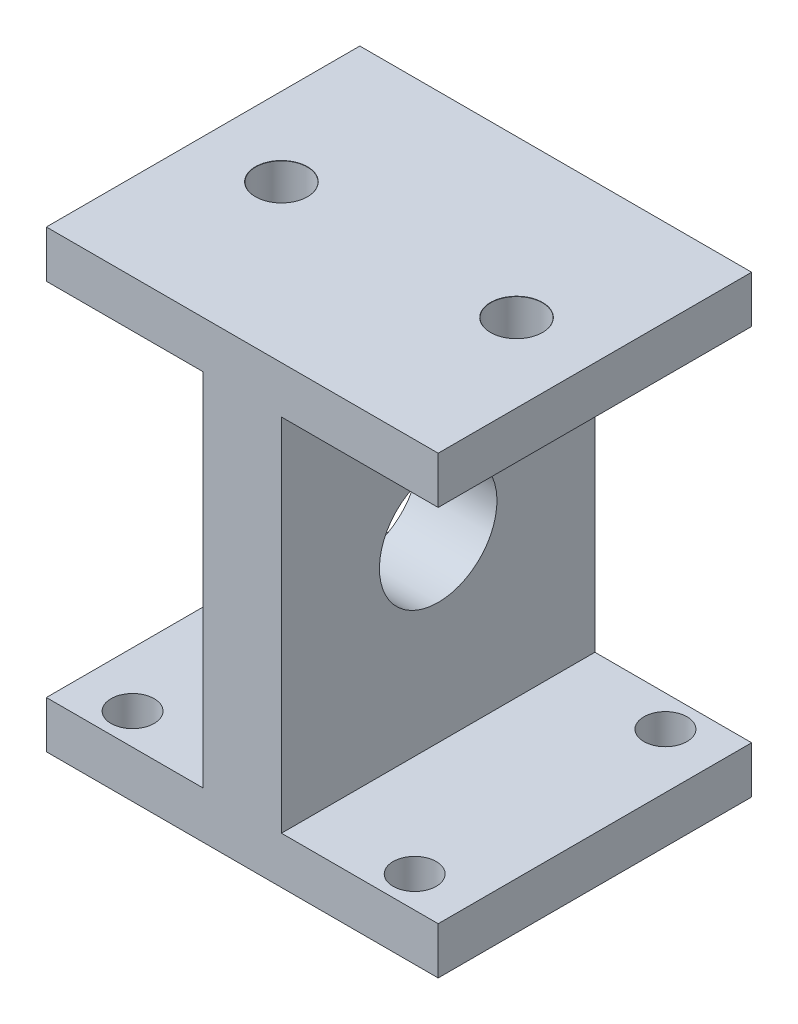
ISO-10303-21;
HEADER;
FILE_DESCRIPTION(('STEP AP214'),'2;1');
FILE_NAME('part.step','',(''),(''),'','','');
FILE_SCHEMA(('AUTOMOTIVE_DESIGN { 1 0 10303 214 1 1 1 1 }'));
ENDSEC;
DATA;
#1=APPLICATION_CONTEXT('core data for automotive mechanical design processes');
#2=APPLICATION_PROTOCOL_DEFINITION('international standard','automotive_design',2000,#1);
#3=PRODUCT_CONTEXT('',#1,'mechanical');
#4=PRODUCT('Part','Part','',(#3));
#5=PRODUCT_RELATED_PRODUCT_CATEGORY('part','',(#4));
#6=PRODUCT_DEFINITION_FORMATION('','',#4);
#7=PRODUCT_DEFINITION_CONTEXT('part definition',#1,'design');
#8=PRODUCT_DEFINITION('design','',#6,#7);
#9=PRODUCT_DEFINITION_SHAPE('','',#8);
#10=(LENGTH_UNIT() NAMED_UNIT(*) SI_UNIT(.MILLI.,.METRE.));
#11=(NAMED_UNIT(*) PLANE_ANGLE_UNIT() SI_UNIT($,.RADIAN.));
#12=(NAMED_UNIT(*) SI_UNIT($,.STERADIAN.) SOLID_ANGLE_UNIT());
#13=UNCERTAINTY_MEASURE_WITH_UNIT(LENGTH_MEASURE(1.E-05),#10,'distance_accuracy_value','');
#14=(GEOMETRIC_REPRESENTATION_CONTEXT(3) GLOBAL_UNCERTAINTY_ASSIGNED_CONTEXT((#13)) GLOBAL_UNIT_ASSIGNED_CONTEXT((#10,
#11,#12)) REPRESENTATION_CONTEXT('',''));
#15=CARTESIAN_POINT('',(0.,0.,0.));
#16=DIRECTION('',(0.,0.,1.));
#17=DIRECTION('',(1.,0.,0.));
#18=AXIS2_PLACEMENT_3D('',#15,#16,#17);
#19=CARTESIAN_POINT('',(25.,29.,40.));
#20=DIRECTION('',(-1.,0.,0.));
#21=DIRECTION('',(0.,-1.,0.));
#22=AXIS2_PLACEMENT_3D('',#19,#20,#21);
#23=PLANE('',#22);
#24=DIRECTION('',(0.,1.,0.));
#25=VECTOR('',#24,1.);
#26=CARTESIAN_POINT('',(25.,29.,40.));
#27=LINE('',#26,#25);
#28=CARTESIAN_POINT('',(25.,23.,40.));
#29=VERTEX_POINT('',#28);
#30=CARTESIAN_POINT('',(25.,29.,40.));
#31=VERTEX_POINT('',#30);
#32=EDGE_CURVE('E195',#29,#31,#27,.T.);
#33=ORIENTED_EDGE('',*,*,#32,.F.);
#34=DIRECTION('',(0.,0.,-1.));
#35=VECTOR('',#34,1.);
#36=CARTESIAN_POINT('',(25.,23.,40.));
#37=LINE('',#36,#35);
#38=CARTESIAN_POINT('',(25.,23.,0.));
#39=VERTEX_POINT('',#38);
#40=EDGE_CURVE('E179',#29,#39,#37,.T.);
#41=ORIENTED_EDGE('',*,*,#40,.T.);
#42=DIRECTION('',(0.,1.,0.));
#43=VECTOR('',#42,1.);
#44=CARTESIAN_POINT('',(25.,29.,0.));
#45=LINE('',#44,#43);
#46=CARTESIAN_POINT('',(25.,29.,0.));
#47=VERTEX_POINT('',#46);
#48=EDGE_CURVE('E189',#39,#47,#45,.T.);
#49=ORIENTED_EDGE('',*,*,#48,.T.);
#50=DIRECTION('',(0.,0.,-1.));
#51=VECTOR('',#50,1.);
#52=CARTESIAN_POINT('',(25.,29.,40.));
#53=LINE('',#52,#51);
#54=EDGE_CURVE('E232',#31,#47,#53,.T.);
#55=ORIENTED_EDGE('',*,*,#54,.F.);
#56=EDGE_LOOP('',(#33,#41,#49,#55));
#57=FACE_BOUND('',#56,.T.);
#58=ADVANCED_FACE('F38',(#57),#23,.F.);
#59=CARTESIAN_POINT('',(-25.,29.,40.));
#60=DIRECTION('',(1.,0.,0.));
#61=DIRECTION('',(0.,1.,0.));
#62=AXIS2_PLACEMENT_3D('',#59,#60,#61);
#63=PLANE('',#62);
#64=DIRECTION('',(0.,-1.,0.));
#65=VECTOR('',#64,1.);
#66=CARTESIAN_POINT('',(-25.,29.,0.));
#67=LINE('',#66,#65);
#68=CARTESIAN_POINT('',(-25.,29.,0.));
#69=VERTEX_POINT('',#68);
#70=CARTESIAN_POINT('',(-25.,23.,0.));
#71=VERTEX_POINT('',#70);
#72=EDGE_CURVE('E214',#69,#71,#67,.T.);
#73=ORIENTED_EDGE('',*,*,#72,.T.);
#74=DIRECTION('',(0.,0.,1.));
#75=VECTOR('',#74,1.);
#76=CARTESIAN_POINT('',(-25.,23.,40.));
#77=LINE('',#76,#75);
#78=CARTESIAN_POINT('',(-25.,23.,40.));
#79=VERTEX_POINT('',#78);
#80=EDGE_CURVE('E185',#71,#79,#77,.T.);
#81=ORIENTED_EDGE('',*,*,#80,.T.);
#82=DIRECTION('',(0.,-1.,0.));
#83=VECTOR('',#82,1.);
#84=CARTESIAN_POINT('',(-25.,29.,40.));
#85=LINE('',#84,#83);
#86=CARTESIAN_POINT('',(-25.,29.,40.));
#87=VERTEX_POINT('',#86);
#88=EDGE_CURVE('E199',#87,#79,#85,.T.);
#89=ORIENTED_EDGE('',*,*,#88,.F.);
#90=DIRECTION('',(0.,0.,-1.));
#91=VECTOR('',#90,1.);
#92=CARTESIAN_POINT('',(-25.,29.,40.));
#93=LINE('',#92,#91);
#94=EDGE_CURVE('E228',#87,#69,#93,.T.);
#95=ORIENTED_EDGE('',*,*,#94,.T.);
#96=EDGE_LOOP('',(#73,#81,#89,#95));
#97=FACE_BOUND('',#96,.T.);
#98=ADVANCED_FACE('F342',(#97),#63,.F.);
#99=CARTESIAN_POINT('',(25.,-29.,0.));
#100=VERTEX_POINT('',#99);
#101=CARTESIAN_POINT('',(25.,-23.,0.));
#102=VERTEX_POINT('',#101);
#103=EDGE_CURVE('E206',#100,#102,#45,.T.);
#104=ORIENTED_EDGE('',*,*,#103,.T.);
#105=DIRECTION('',(0.,0.,1.));
#106=VECTOR('',#105,1.);
#107=CARTESIAN_POINT('',(25.,-23.,40.));
#108=LINE('',#107,#106);
#109=CARTESIAN_POINT('',(25.,-23.,40.));
#110=VERTEX_POINT('',#109);
#111=EDGE_CURVE('E158',#102,#110,#108,.T.);
#112=ORIENTED_EDGE('',*,*,#111,.T.);
#113=CARTESIAN_POINT('',(25.,-29.,40.));
#114=VERTEX_POINT('',#113);
#115=EDGE_CURVE('E190',#114,#110,#27,.T.);
#116=ORIENTED_EDGE('',*,*,#115,.F.);
#117=DIRECTION('',(0.,0.,-1.));
#118=VECTOR('',#117,1.);
#119=CARTESIAN_POINT('',(25.,-29.,40.));
#120=LINE('',#119,#118);
#121=EDGE_CURVE('E205',#114,#100,#120,.T.);
#122=ORIENTED_EDGE('',*,*,#121,.T.);
#123=EDGE_LOOP('',(#104,#112,#116,#122));
#124=FACE_BOUND('',#123,.T.);
#125=ADVANCED_FACE('F40',(#124),#23,.F.);
#126=CARTESIAN_POINT('',(-25.,29.,40.));
#127=DIRECTION('',(0.,-1.,0.));
#128=DIRECTION('',(0.,0.,-1.));
#129=AXIS2_PLACEMENT_3D('',#126,#127,#128);
#130=PLANE('',#129);
#131=CARTESIAN_POINT('',(-15.,29.,20.));
#132=DIRECTION('',(0.,1.,0.));
#133=DIRECTION('',(0.,0.,1.));
#134=AXIS2_PLACEMENT_3D('',#131,#132,#133);
#135=CIRCLE('',#134,3.325);
#136=CARTESIAN_POINT('',(-15.,29.,23.325));
#137=VERTEX_POINT('',#136);
#138=EDGE_CURVE('E597',#137,#137,#135,.T.);
#139=ORIENTED_EDGE('',*,*,#138,.F.);
#140=EDGE_LOOP('',(#139));
#141=FACE_BOUND('',#140,.T.);
#142=CARTESIAN_POINT('',(15.,29.,20.));
#143=DIRECTION('',(0.,1.,0.));
#144=DIRECTION('',(0.,0.,1.));
#145=AXIS2_PLACEMENT_3D('',#142,#143,#144);
#146=CIRCLE('',#145,3.325);
#147=CARTESIAN_POINT('',(15.,29.,23.325));
#148=VERTEX_POINT('',#147);
#149=EDGE_CURVE('E288',#148,#148,#146,.T.);
#150=ORIENTED_EDGE('',*,*,#149,.F.);
#151=EDGE_LOOP('',(#150));
#152=FACE_BOUND('',#151,.T.);
#153=DIRECTION('',(-1.,0.,0.));
#154=VECTOR('',#153,1.);
#155=CARTESIAN_POINT('',(-25.,29.,0.));
#156=LINE('',#155,#154);
#157=EDGE_CURVE('E210',#47,#69,#156,.T.);
#158=ORIENTED_EDGE('',*,*,#157,.T.);
#159=ORIENTED_EDGE('',*,*,#94,.F.);
#160=DIRECTION('',(-1.,0.,0.));
#161=VECTOR('',#160,1.);
#162=CARTESIAN_POINT('',(-25.,29.,40.));
#163=LINE('',#162,#161);
#164=EDGE_CURVE('E194',#31,#87,#163,.T.);
#165=ORIENTED_EDGE('',*,*,#164,.F.);
#166=ORIENTED_EDGE('',*,*,#54,.T.);
#167=EDGE_LOOP('',(#158,#159,#165,#166));
#168=FACE_BOUND('',#167,.T.);
#169=ADVANCED_FACE('F352',(#141,#152,#168),#130,.F.);
#170=CARTESIAN_POINT('',(-25.,-23.,40.));
#171=VERTEX_POINT('',#170);
#172=CARTESIAN_POINT('',(-25.,-29.,40.));
#173=VERTEX_POINT('',#172);
#174=EDGE_CURVE('E198',#171,#173,#85,.T.);
#175=ORIENTED_EDGE('',*,*,#174,.F.);
#176=DIRECTION('',(0.,0.,-1.));
#177=VECTOR('',#176,1.);
#178=CARTESIAN_POINT('',(-25.,-23.,40.));
#179=LINE('',#178,#177);
#180=CARTESIAN_POINT('',(-25.,-23.,0.));
#181=VERTEX_POINT('',#180);
#182=EDGE_CURVE('E144',#171,#181,#179,.T.);
#183=ORIENTED_EDGE('',*,*,#182,.T.);
#184=CARTESIAN_POINT('',(-25.,-29.,0.));
#185=VERTEX_POINT('',#184);
#186=EDGE_CURVE('E213',#181,#185,#67,.T.);
#187=ORIENTED_EDGE('',*,*,#186,.T.);
#188=DIRECTION('',(0.,0.,-1.));
#189=VECTOR('',#188,1.);
#190=CARTESIAN_POINT('',(-25.,-29.,40.));
#191=LINE('',#190,#189);
#192=EDGE_CURVE('E224',#173,#185,#191,.T.);
#193=ORIENTED_EDGE('',*,*,#192,.F.);
#194=EDGE_LOOP('',(#175,#183,#187,#193));
#195=FACE_BOUND('',#194,.T.);
#196=ADVANCED_FACE('F349',(#195),#63,.F.);
#197=CARTESIAN_POINT('',(-25.,-29.,40.));
#198=DIRECTION('',(0.,1.,0.));
#199=DIRECTION('',(0.,0.,1.));
#200=AXIS2_PLACEMENT_3D('',#197,#198,#199);
#201=PLANE('',#200);
#202=CARTESIAN_POINT('',(18.,-29.,4.));
#203=DIRECTION('',(0.,-1.,0.));
#204=DIRECTION('',(0.,0.,-1.));
#205=AXIS2_PLACEMENT_3D('',#202,#203,#204);
#206=CIRCLE('',#205,2.775);
#207=CARTESIAN_POINT('',(18.,-29.,1.225));
#208=VERTEX_POINT('',#207);
#209=EDGE_CURVE('E279',#208,#208,#206,.T.);
#210=ORIENTED_EDGE('',*,*,#209,.F.);
#211=EDGE_LOOP('',(#210));
#212=FACE_BOUND('',#211,.T.);
#213=CARTESIAN_POINT('',(-18.,-29.,3.99999999999999));
#214=DIRECTION('',(0.,-1.,0.));
#215=DIRECTION('',(0.,0.,-1.));
#216=AXIS2_PLACEMENT_3D('',#213,#214,#215);
#217=CIRCLE('',#216,2.775);
#218=CARTESIAN_POINT('',(-18.,-29.,1.225));
#219=VERTEX_POINT('',#218);
#220=EDGE_CURVE('E274',#219,#219,#217,.T.);
#221=ORIENTED_EDGE('',*,*,#220,.F.);
#222=EDGE_LOOP('',(#221));
#223=FACE_BOUND('',#222,.T.);
#224=CARTESIAN_POINT('',(-18.,-29.,36.));
#225=DIRECTION('',(0.,-1.,0.));
#226=DIRECTION('',(0.,0.,-1.));
#227=AXIS2_PLACEMENT_3D('',#224,#225,#226);
#228=CIRCLE('',#227,2.775);
#229=CARTESIAN_POINT('',(-18.,-29.,33.225));
#230=VERTEX_POINT('',#229);
#231=EDGE_CURVE('E269',#230,#230,#228,.T.);
#232=ORIENTED_EDGE('',*,*,#231,.F.);
#233=EDGE_LOOP('',(#232));
#234=FACE_BOUND('',#233,.T.);
#235=CARTESIAN_POINT('',(18.,-29.,36.));
#236=DIRECTION('',(0.,-1.,0.));
#237=DIRECTION('',(0.,0.,-1.));
#238=AXIS2_PLACEMENT_3D('',#235,#236,#237);
#239=CIRCLE('',#238,2.775);
#240=CARTESIAN_POINT('',(18.,-29.,33.225));
#241=VERTEX_POINT('',#240);
#242=EDGE_CURVE('E263',#241,#241,#239,.T.);
#243=ORIENTED_EDGE('',*,*,#242,.F.);
#244=EDGE_LOOP('',(#243));
#245=FACE_BOUND('',#244,.T.);
#246=DIRECTION('',(1.,0.,0.));
#247=VECTOR('',#246,1.);
#248=CARTESIAN_POINT('',(-25.,-29.,0.));
#249=LINE('',#248,#247);
#250=EDGE_CURVE('E218',#185,#100,#249,.T.);
#251=ORIENTED_EDGE('',*,*,#250,.T.);
#252=ORIENTED_EDGE('',*,*,#121,.F.);
#253=DIRECTION('',(1.,0.,0.));
#254=VECTOR('',#253,1.);
#255=CARTESIAN_POINT('',(-25.,-29.,40.));
#256=LINE('',#255,#254);
#257=EDGE_CURVE('E202',#173,#114,#256,.T.);
#258=ORIENTED_EDGE('',*,*,#257,.F.);
#259=ORIENTED_EDGE('',*,*,#192,.T.);
#260=EDGE_LOOP('',(#251,#252,#258,#259));
#261=FACE_BOUND('',#260,.T.);
#262=ADVANCED_FACE('F373',(#212,#223,#234,#245,#261),#201,.F.);
#263=CARTESIAN_POINT('',(0.,0.,40.));
#264=DIRECTION('',(0.,0.,1.));
#265=DIRECTION('',(1.,0.,0.));
#266=AXIS2_PLACEMENT_3D('',#263,#264,#265);
#267=PLANE('',#266);
#268=DIRECTION('',(-1.,0.,0.));
#269=VECTOR('',#268,1.);
#270=CARTESIAN_POINT('',(-37.7928187136335,23.,40.));
#271=LINE('',#270,#269);
#272=CARTESIAN_POINT('',(-5.,23.,40.));
#273=VERTEX_POINT('',#272);
#274=EDGE_CURVE('E138',#273,#79,#271,.T.);
#275=ORIENTED_EDGE('',*,*,#274,.F.);
#276=DIRECTION('',(0.,1.,0.));
#277=VECTOR('',#276,1.);
#278=CARTESIAN_POINT('',(-5.,23.,40.));
#279=LINE('',#278,#277);
#280=CARTESIAN_POINT('',(-4.99999999999999,-23.,40.));
#281=VERTEX_POINT('',#280);
#282=EDGE_CURVE('E132',#281,#273,#279,.T.);
#283=ORIENTED_EDGE('',*,*,#282,.F.);
#284=DIRECTION('',(1.,0.,0.));
#285=VECTOR('',#284,1.);
#286=CARTESIAN_POINT('',(-37.7928187136335,-23.,40.));
#287=LINE('',#286,#285);
#288=EDGE_CURVE('E141',#171,#281,#287,.T.);
#289=ORIENTED_EDGE('',*,*,#288,.F.);
#290=ORIENTED_EDGE('',*,*,#174,.T.);
#291=ORIENTED_EDGE('',*,*,#257,.T.);
#292=ORIENTED_EDGE('',*,*,#115,.T.);
#293=DIRECTION('',(1.,0.,0.));
#294=VECTOR('',#293,1.);
#295=CARTESIAN_POINT('',(37.7928187136335,-23.,40.));
#296=LINE('',#295,#294);
#297=CARTESIAN_POINT('',(4.99999999999999,-23.,40.));
#298=VERTEX_POINT('',#297);
#299=EDGE_CURVE('E167',#298,#110,#296,.T.);
#300=ORIENTED_EDGE('',*,*,#299,.F.);
#301=DIRECTION('',(0.,-1.,0.));
#302=VECTOR('',#301,1.);
#303=CARTESIAN_POINT('',(5.,23.,40.));
#304=LINE('',#303,#302);
#305=CARTESIAN_POINT('',(5.,23.,40.));
#306=VERTEX_POINT('',#305);
#307=EDGE_CURVE('E163',#306,#298,#304,.T.);
#308=ORIENTED_EDGE('',*,*,#307,.F.);
#309=DIRECTION('',(-1.,0.,0.));
#310=VECTOR('',#309,1.);
#311=CARTESIAN_POINT('',(37.7928187136335,23.,40.));
#312=LINE('',#311,#310);
#313=EDGE_CURVE('E160',#29,#306,#312,.T.);
#314=ORIENTED_EDGE('',*,*,#313,.F.);
#315=ORIENTED_EDGE('',*,*,#32,.T.);
#316=ORIENTED_EDGE('',*,*,#164,.T.);
#317=ORIENTED_EDGE('',*,*,#88,.T.);
#318=EDGE_LOOP('',(#275,#283,#289,#290,#291,#292,#300,#308,#314,#315,#316,#317));
#319=FACE_BOUND('',#318,.T.);
#320=ADVANCED_FACE('F149',(#319),#267,.T.);
#321=CARTESIAN_POINT('',(0.,0.,0.));
#322=DIRECTION('',(0.,0.,1.));
#323=DIRECTION('',(1.,0.,0.));
#324=AXIS2_PLACEMENT_3D('',#321,#322,#323);
#325=PLANE('',#324);
#326=DIRECTION('',(0.,1.,0.));
#327=VECTOR('',#326,1.);
#328=CARTESIAN_POINT('',(-4.99999999999999,0.,0.));
#329=LINE('',#328,#327);
#330=CARTESIAN_POINT('',(-4.99999999999999,-23.,0.));
#331=VERTEX_POINT('',#330);
#332=CARTESIAN_POINT('',(-5.,23.,0.));
#333=VERTEX_POINT('',#332);
#334=EDGE_CURVE('E48',#331,#333,#329,.T.);
#335=ORIENTED_EDGE('',*,*,#334,.T.);
#336=DIRECTION('',(-1.,0.,0.));
#337=VECTOR('',#336,1.);
#338=CARTESIAN_POINT('',(0.,23.,0.));
#339=LINE('',#338,#337);
#340=EDGE_CURVE('E11',#333,#71,#339,.T.);
#341=ORIENTED_EDGE('',*,*,#340,.T.);
#342=ORIENTED_EDGE('',*,*,#72,.F.);
#343=ORIENTED_EDGE('',*,*,#157,.F.);
#344=ORIENTED_EDGE('',*,*,#48,.F.);
#345=DIRECTION('',(-1.,0.,0.));
#346=VECTOR('',#345,1.);
#347=CARTESIAN_POINT('',(0.,23.,0.));
#348=LINE('',#347,#346);
#349=CARTESIAN_POINT('',(5.,23.,0.));
#350=VERTEX_POINT('',#349);
#351=EDGE_CURVE('E244',#39,#350,#348,.T.);
#352=ORIENTED_EDGE('',*,*,#351,.T.);
#353=DIRECTION('',(0.,-1.,0.));
#354=VECTOR('',#353,1.);
#355=CARTESIAN_POINT('',(4.99999999999999,0.,0.));
#356=LINE('',#355,#354);
#357=CARTESIAN_POINT('',(4.99999999999999,-23.,0.));
#358=VERTEX_POINT('',#357);
#359=EDGE_CURVE('E236',#350,#358,#356,.T.);
#360=ORIENTED_EDGE('',*,*,#359,.T.);
#361=DIRECTION('',(1.,0.,0.));
#362=VECTOR('',#361,1.);
#363=CARTESIAN_POINT('',(0.,-23.,0.));
#364=LINE('',#363,#362);
#365=EDGE_CURVE('E240',#358,#102,#364,.T.);
#366=ORIENTED_EDGE('',*,*,#365,.T.);
#367=ORIENTED_EDGE('',*,*,#103,.F.);
#368=ORIENTED_EDGE('',*,*,#250,.F.);
#369=ORIENTED_EDGE('',*,*,#186,.F.);
#370=DIRECTION('',(1.,0.,0.));
#371=VECTOR('',#370,1.);
#372=CARTESIAN_POINT('',(0.,-23.,0.));
#373=LINE('',#372,#371);
#374=EDGE_CURVE('E248',#181,#331,#373,.T.);
#375=ORIENTED_EDGE('',*,*,#374,.T.);
#376=EDGE_LOOP('',(#335,#341,#342,#343,#344,#352,#360,#366,#367,#368,#369,#375));
#377=FACE_BOUND('',#376,.T.);
#378=ADVANCED_FACE('F363',(#377),#325,.F.);
#379=CARTESIAN_POINT('',(37.7928187136335,23.,-20.));
#380=DIRECTION('',(0.,1.,0.));
#381=DIRECTION('',(0.,0.,1.));
#382=AXIS2_PLACEMENT_3D('',#379,#380,#381);
#383=PLANE('',#382);
#384=CARTESIAN_POINT('',(15.,23.,20.));
#385=DIRECTION('',(0.,1.,0.));
#386=DIRECTION('',(0.,0.,1.));
#387=AXIS2_PLACEMENT_3D('',#384,#385,#386);
#388=CIRCLE('',#387,3.3);
#389=CARTESIAN_POINT('',(15.,23.,23.3));
#390=VERTEX_POINT('',#389);
#391=EDGE_CURVE('E276',#390,#390,#388,.T.);
#392=ORIENTED_EDGE('',*,*,#391,.T.);
#393=EDGE_LOOP('',(#392));
#394=FACE_BOUND('',#393,.T.);
#395=ORIENTED_EDGE('',*,*,#313,.T.);
#396=DIRECTION('',(0.,0.,1.));
#397=VECTOR('',#396,1.);
#398=CARTESIAN_POINT('',(5.,23.,-20.));
#399=LINE('',#398,#397);
#400=EDGE_CURVE('E170',#350,#306,#399,.T.);
#401=ORIENTED_EDGE('',*,*,#400,.F.);
#402=ORIENTED_EDGE('',*,*,#351,.F.);
#403=ORIENTED_EDGE('',*,*,#40,.F.);
#404=EDGE_LOOP('',(#395,#401,#402,#403));
#405=FACE_BOUND('',#404,.T.);
#406=ADVANCED_FACE('F389',(#394,#405),#383,.F.);
#407=CARTESIAN_POINT('',(37.7928187136335,-23.,-20.));
#408=DIRECTION('',(0.,-1.,0.));
#409=DIRECTION('',(0.,0.,-1.));
#410=AXIS2_PLACEMENT_3D('',#407,#408,#409);
#411=PLANE('',#410);
#412=CARTESIAN_POINT('',(18.,-23.,4.));
#413=DIRECTION('',(0.,-1.,0.));
#414=DIRECTION('',(0.,0.,-1.));
#415=AXIS2_PLACEMENT_3D('',#412,#413,#414);
#416=CIRCLE('',#415,2.75);
#417=CARTESIAN_POINT('',(18.,-23.,1.25));
#418=VERTEX_POINT('',#417);
#419=EDGE_CURVE('E271',#418,#418,#416,.T.);
#420=ORIENTED_EDGE('',*,*,#419,.T.);
#421=EDGE_LOOP('',(#420));
#422=FACE_BOUND('',#421,.T.);
#423=CARTESIAN_POINT('',(18.,-23.,36.));
#424=DIRECTION('',(0.,-1.,0.));
#425=DIRECTION('',(0.,0.,-1.));
#426=AXIS2_PLACEMENT_3D('',#423,#424,#425);
#427=CIRCLE('',#426,2.75);
#428=CARTESIAN_POINT('',(18.,-23.,33.25));
#429=VERTEX_POINT('',#428);
#430=EDGE_CURVE('E253',#429,#429,#427,.T.);
#431=ORIENTED_EDGE('',*,*,#430,.T.);
#432=EDGE_LOOP('',(#431));
#433=FACE_BOUND('',#432,.T.);
#434=ORIENTED_EDGE('',*,*,#365,.F.);
#435=DIRECTION('',(0.,0.,1.));
#436=VECTOR('',#435,1.);
#437=CARTESIAN_POINT('',(4.99999999999999,-23.,-20.));
#438=LINE('',#437,#436);
#439=EDGE_CURVE('E64',#358,#298,#438,.T.);
#440=ORIENTED_EDGE('',*,*,#439,.T.);
#441=ORIENTED_EDGE('',*,*,#299,.T.);
#442=ORIENTED_EDGE('',*,*,#111,.F.);
#443=EDGE_LOOP('',(#434,#440,#441,#442));
#444=FACE_BOUND('',#443,.T.);
#445=ADVANCED_FACE('F366',(#422,#433,#444),#411,.F.);
#446=CARTESIAN_POINT('',(5.,23.,-20.));
#447=DIRECTION('',(-1.,0.,0.));
#448=DIRECTION('',(0.,-1.,0.));
#449=AXIS2_PLACEMENT_3D('',#446,#447,#448);
#450=PLANE('',#449);
#451=CARTESIAN_POINT('',(4.99999999999999,0.,20.));
#452=DIRECTION('',(-1.,0.,0.));
#453=DIRECTION('',(0.,-1.,0.));
#454=AXIS2_PLACEMENT_3D('',#451,#452,#453);
#455=CIRCLE('',#454,7.5);
#456=CARTESIAN_POINT('',(4.99999999999999,-7.50000000000001,20.));
#457=VERTEX_POINT('',#456);
#458=EDGE_CURVE('E164',#457,#457,#455,.T.);
#459=ORIENTED_EDGE('',*,*,#458,.T.);
#460=EDGE_LOOP('',(#459));
#461=FACE_BOUND('',#460,.T.);
#462=ORIENTED_EDGE('',*,*,#400,.T.);
#463=ORIENTED_EDGE('',*,*,#307,.T.);
#464=ORIENTED_EDGE('',*,*,#439,.F.);
#465=ORIENTED_EDGE('',*,*,#359,.F.);
#466=EDGE_LOOP('',(#462,#463,#464,#465));
#467=FACE_BOUND('',#466,.T.);
#468=ADVANCED_FACE('F324',(#461,#467),#450,.F.);
#469=CARTESIAN_POINT('',(-37.7928187136335,23.,-20.));
#470=DIRECTION('',(0.,1.,0.));
#471=DIRECTION('',(0.,0.,1.));
#472=AXIS2_PLACEMENT_3D('',#469,#470,#471);
#473=PLANE('',#472);
#474=CARTESIAN_POINT('',(-15.,23.,20.));
#475=DIRECTION('',(0.,1.,0.));
#476=DIRECTION('',(0.,0.,1.));
#477=AXIS2_PLACEMENT_3D('',#474,#475,#476);
#478=CIRCLE('',#477,3.3);
#479=CARTESIAN_POINT('',(-15.,23.,23.3));
#480=VERTEX_POINT('',#479);
#481=EDGE_CURVE('E42',#480,#480,#478,.T.);
#482=ORIENTED_EDGE('',*,*,#481,.T.);
#483=EDGE_LOOP('',(#482));
#484=FACE_BOUND('',#483,.T.);
#485=ORIENTED_EDGE('',*,*,#340,.F.);
#486=DIRECTION('',(0.,0.,1.));
#487=VECTOR('',#486,1.);
#488=CARTESIAN_POINT('',(-5.,23.,-20.));
#489=LINE('',#488,#487);
#490=EDGE_CURVE('E137',#333,#273,#489,.T.);
#491=ORIENTED_EDGE('',*,*,#490,.T.);
#492=ORIENTED_EDGE('',*,*,#274,.T.);
#493=ORIENTED_EDGE('',*,*,#80,.F.);
#494=EDGE_LOOP('',(#485,#491,#492,#493));
#495=FACE_BOUND('',#494,.T.);
#496=ADVANCED_FACE('F391',(#484,#495),#473,.F.);
#497=CARTESIAN_POINT('',(-5.,23.,-20.));
#498=DIRECTION('',(1.,0.,0.));
#499=DIRECTION('',(0.,1.,0.));
#500=AXIS2_PLACEMENT_3D('',#497,#498,#499);
#501=PLANE('',#500);
#502=CARTESIAN_POINT('',(-4.99999999999999,0.,20.));
#503=DIRECTION('',(-1.,0.,0.));
#504=DIRECTION('',(0.,-1.,0.));
#505=AXIS2_PLACEMENT_3D('',#502,#503,#504);
#506=CIRCLE('',#505,7.5);
#507=CARTESIAN_POINT('',(-4.99999999999999,-7.50000000000001,20.));
#508=VERTEX_POINT('',#507);
#509=EDGE_CURVE('E257',#508,#508,#506,.T.);
#510=ORIENTED_EDGE('',*,*,#509,.F.);
#511=EDGE_LOOP('',(#510));
#512=FACE_BOUND('',#511,.T.);
#513=DIRECTION('',(0.,0.,1.));
#514=VECTOR('',#513,1.);
#515=CARTESIAN_POINT('',(-4.99999999999999,-23.,-20.));
#516=LINE('',#515,#514);
#517=EDGE_CURVE('E56',#331,#281,#516,.T.);
#518=ORIENTED_EDGE('',*,*,#517,.T.);
#519=ORIENTED_EDGE('',*,*,#282,.T.);
#520=ORIENTED_EDGE('',*,*,#490,.F.);
#521=ORIENTED_EDGE('',*,*,#334,.F.);
#522=EDGE_LOOP('',(#518,#519,#520,#521));
#523=FACE_BOUND('',#522,.T.);
#524=ADVANCED_FACE('F129',(#512,#523),#501,.F.);
#525=CARTESIAN_POINT('',(-37.7928187136335,-23.,-20.));
#526=DIRECTION('',(0.,-1.,0.));
#527=DIRECTION('',(0.,0.,-1.));
#528=AXIS2_PLACEMENT_3D('',#525,#526,#527);
#529=PLANE('',#528);
#530=CARTESIAN_POINT('',(-18.,-23.,3.99999999999999));
#531=DIRECTION('',(0.,-1.,0.));
#532=DIRECTION('',(0.,0.,-1.));
#533=AXIS2_PLACEMENT_3D('',#530,#531,#532);
#534=CIRCLE('',#533,2.75);
#535=CARTESIAN_POINT('',(-18.,-23.,1.25));
#536=VERTEX_POINT('',#535);
#537=EDGE_CURVE('E265',#536,#536,#534,.T.);
#538=ORIENTED_EDGE('',*,*,#537,.T.);
#539=EDGE_LOOP('',(#538));
#540=FACE_BOUND('',#539,.T.);
#541=CARTESIAN_POINT('',(-18.,-23.,36.));
#542=DIRECTION('',(0.,-1.,0.));
#543=DIRECTION('',(0.,0.,-1.));
#544=AXIS2_PLACEMENT_3D('',#541,#542,#543);
#545=CIRCLE('',#544,2.75);
#546=CARTESIAN_POINT('',(-18.,-23.,33.25));
#547=VERTEX_POINT('',#546);
#548=EDGE_CURVE('E259',#547,#547,#545,.T.);
#549=ORIENTED_EDGE('',*,*,#548,.T.);
#550=EDGE_LOOP('',(#549));
#551=FACE_BOUND('',#550,.T.);
#552=ORIENTED_EDGE('',*,*,#288,.T.);
#553=ORIENTED_EDGE('',*,*,#517,.F.);
#554=ORIENTED_EDGE('',*,*,#374,.F.);
#555=ORIENTED_EDGE('',*,*,#182,.F.);
#556=EDGE_LOOP('',(#552,#553,#554,#555));
#557=FACE_BOUND('',#556,.T.);
#558=ADVANCED_FACE('F142',(#540,#551,#557),#529,.F.);
#559=CARTESIAN_POINT('',(30.,0.,20.));
#560=DIRECTION('',(-1.,0.,0.));
#561=DIRECTION('',(0.,-1.,0.));
#562=AXIS2_PLACEMENT_3D('',#559,#560,#561);
#563=CYLINDRICAL_SURFACE('',#562,7.5);
#564=ORIENTED_EDGE('',*,*,#509,.T.);
#565=EDGE_LOOP('',(#564));
#566=FACE_BOUND('',#565,.T.);
#567=ORIENTED_EDGE('',*,*,#458,.F.);
#568=EDGE_LOOP('',(#567));
#569=FACE_BOUND('',#568,.T.);
#570=ADVANCED_FACE('F326',(#566,#569),#563,.F.);
#571=CARTESIAN_POINT('',(18.,-29.,36.));
#572=DIRECTION('',(0.,-1.,0.));
#573=DIRECTION('',(0.,0.,-1.));
#574=AXIS2_PLACEMENT_3D('',#571,#572,#573);
#575=CYLINDRICAL_SURFACE('',#574,2.75);
#576=CARTESIAN_POINT('',(18.,-28.975,36.));
#577=DIRECTION('',(0.,-1.,0.));
#578=DIRECTION('',(0.,0.,-1.));
#579=AXIS2_PLACEMENT_3D('',#576,#577,#578);
#580=CIRCLE('',#579,2.75);
#581=CARTESIAN_POINT('',(18.,-28.975,33.25));
#582=VERTEX_POINT('',#581);
#583=EDGE_CURVE('E258',#582,#582,#580,.T.);
#584=ORIENTED_EDGE('',*,*,#583,.T.);
#585=EDGE_LOOP('',(#584));
#586=FACE_BOUND('',#585,.T.);
#587=ORIENTED_EDGE('',*,*,#430,.F.);
#588=EDGE_LOOP('',(#587));
#589=FACE_BOUND('',#588,.T.);
#590=ADVANCED_FACE('F328',(#586,#589),#575,.F.);
#591=CARTESIAN_POINT('',(18.,-29.,36.));
#592=DIRECTION('',(0.,-1.,0.));
#593=DIRECTION('',(0.,0.,-1.));
#594=AXIS2_PLACEMENT_3D('',#591,#592,#593);
#595=CONICAL_SURFACE('',#594,2.775,0.785398163397379);
#596=ORIENTED_EDGE('',*,*,#583,.F.);
#597=EDGE_LOOP('',(#596));
#598=FACE_BOUND('',#597,.T.);
#599=ORIENTED_EDGE('',*,*,#242,.T.);
#600=EDGE_LOOP('',(#599));
#601=FACE_BOUND('',#600,.T.);
#602=ADVANCED_FACE('F335',(#598,#601),#595,.F.);
#603=CARTESIAN_POINT('',(-18.,-29.,36.));
#604=DIRECTION('',(0.,-1.,0.));
#605=DIRECTION('',(0.,0.,-1.));
#606=AXIS2_PLACEMENT_3D('',#603,#604,#605);
#607=CYLINDRICAL_SURFACE('',#606,2.75);
#608=CARTESIAN_POINT('',(-18.,-28.975,36.));
#609=DIRECTION('',(0.,-1.,0.));
#610=DIRECTION('',(0.,0.,-1.));
#611=AXIS2_PLACEMENT_3D('',#608,#609,#610);
#612=CIRCLE('',#611,2.75);
#613=CARTESIAN_POINT('',(-18.,-28.975,33.25));
#614=VERTEX_POINT('',#613);
#615=EDGE_CURVE('E264',#614,#614,#612,.T.);
#616=ORIENTED_EDGE('',*,*,#615,.T.);
#617=EDGE_LOOP('',(#616));
#618=FACE_BOUND('',#617,.T.);
#619=ORIENTED_EDGE('',*,*,#548,.F.);
#620=EDGE_LOOP('',(#619));
#621=FACE_BOUND('',#620,.T.);
#622=ADVANCED_FACE('F460',(#618,#621),#607,.F.);
#623=CARTESIAN_POINT('',(-18.,-29.,36.));
#624=DIRECTION('',(0.,-1.,0.));
#625=DIRECTION('',(0.,0.,-1.));
#626=AXIS2_PLACEMENT_3D('',#623,#624,#625);
#627=CONICAL_SURFACE('',#626,2.775,0.785398163397379);
#628=ORIENTED_EDGE('',*,*,#615,.F.);
#629=EDGE_LOOP('',(#628));
#630=FACE_BOUND('',#629,.T.);
#631=ORIENTED_EDGE('',*,*,#231,.T.);
#632=EDGE_LOOP('',(#631));
#633=FACE_BOUND('',#632,.T.);
#634=ADVANCED_FACE('F470',(#630,#633),#627,.F.);
#635=CARTESIAN_POINT('',(-18.,-29.,3.99999999999999));
#636=DIRECTION('',(0.,-1.,0.));
#637=DIRECTION('',(0.,0.,-1.));
#638=AXIS2_PLACEMENT_3D('',#635,#636,#637);
#639=CYLINDRICAL_SURFACE('',#638,2.75);
#640=CARTESIAN_POINT('',(-18.,-28.975,3.99999999999999));
#641=DIRECTION('',(0.,-1.,0.));
#642=DIRECTION('',(0.,0.,-1.));
#643=AXIS2_PLACEMENT_3D('',#640,#641,#642);
#644=CIRCLE('',#643,2.75);
#645=CARTESIAN_POINT('',(-18.,-28.975,1.25));
#646=VERTEX_POINT('',#645);
#647=EDGE_CURVE('E270',#646,#646,#644,.T.);
#648=ORIENTED_EDGE('',*,*,#647,.T.);
#649=EDGE_LOOP('',(#648));
#650=FACE_BOUND('',#649,.T.);
#651=ORIENTED_EDGE('',*,*,#537,.F.);
#652=EDGE_LOOP('',(#651));
#653=FACE_BOUND('',#652,.T.);
#654=ADVANCED_FACE('F480',(#650,#653),#639,.F.);
#655=CARTESIAN_POINT('',(-18.,-29.,3.99999999999999));
#656=DIRECTION('',(0.,-1.,0.));
#657=DIRECTION('',(0.,0.,-1.));
#658=AXIS2_PLACEMENT_3D('',#655,#656,#657);
#659=CONICAL_SURFACE('',#658,2.775,0.785398163397379);
#660=ORIENTED_EDGE('',*,*,#647,.F.);
#661=EDGE_LOOP('',(#660));
#662=FACE_BOUND('',#661,.T.);
#663=ORIENTED_EDGE('',*,*,#220,.T.);
#664=EDGE_LOOP('',(#663));
#665=FACE_BOUND('',#664,.T.);
#666=ADVANCED_FACE('F490',(#662,#665),#659,.F.);
#667=CARTESIAN_POINT('',(18.,-29.,4.));
#668=DIRECTION('',(0.,-1.,0.));
#669=DIRECTION('',(0.,0.,-1.));
#670=AXIS2_PLACEMENT_3D('',#667,#668,#669);
#671=CYLINDRICAL_SURFACE('',#670,2.75);
#672=CARTESIAN_POINT('',(18.,-28.975,4.));
#673=DIRECTION('',(0.,-1.,0.));
#674=DIRECTION('',(0.,0.,-1.));
#675=AXIS2_PLACEMENT_3D('',#672,#673,#674);
#676=CIRCLE('',#675,2.75);
#677=CARTESIAN_POINT('',(18.,-28.975,1.25));
#678=VERTEX_POINT('',#677);
#679=EDGE_CURVE('E275',#678,#678,#676,.T.);
#680=ORIENTED_EDGE('',*,*,#679,.T.);
#681=EDGE_LOOP('',(#680));
#682=FACE_BOUND('',#681,.T.);
#683=ORIENTED_EDGE('',*,*,#419,.F.);
#684=EDGE_LOOP('',(#683));
#685=FACE_BOUND('',#684,.T.);
#686=ADVANCED_FACE('F500',(#682,#685),#671,.F.);
#687=CARTESIAN_POINT('',(18.,-29.,4.));
#688=DIRECTION('',(0.,-1.,0.));
#689=DIRECTION('',(0.,0.,-1.));
#690=AXIS2_PLACEMENT_3D('',#687,#688,#689);
#691=CONICAL_SURFACE('',#690,2.775,0.785398163397379);
#692=ORIENTED_EDGE('',*,*,#679,.F.);
#693=EDGE_LOOP('',(#692));
#694=FACE_BOUND('',#693,.T.);
#695=ORIENTED_EDGE('',*,*,#209,.T.);
#696=EDGE_LOOP('',(#695));
#697=FACE_BOUND('',#696,.T.);
#698=ADVANCED_FACE('F510',(#694,#697),#691,.F.);
#699=CARTESIAN_POINT('',(15.,29.,20.));
#700=DIRECTION('',(0.,1.,0.));
#701=DIRECTION('',(0.,0.,1.));
#702=AXIS2_PLACEMENT_3D('',#699,#700,#701);
#703=CYLINDRICAL_SURFACE('',#702,3.3);
#704=CARTESIAN_POINT('',(15.,28.975,20.));
#705=DIRECTION('',(0.,1.,0.));
#706=DIRECTION('',(0.,0.,1.));
#707=AXIS2_PLACEMENT_3D('',#704,#705,#706);
#708=CIRCLE('',#707,3.3);
#709=CARTESIAN_POINT('',(15.,28.975,23.3));
#710=VERTEX_POINT('',#709);
#711=EDGE_CURVE('E280',#710,#710,#708,.T.);
#712=ORIENTED_EDGE('',*,*,#711,.T.);
#713=EDGE_LOOP('',(#712));
#714=FACE_BOUND('',#713,.T.);
#715=ORIENTED_EDGE('',*,*,#391,.F.);
#716=EDGE_LOOP('',(#715));
#717=FACE_BOUND('',#716,.T.);
#718=ADVANCED_FACE('F519',(#714,#717),#703,.F.);
#719=CARTESIAN_POINT('',(15.,29.,20.));
#720=DIRECTION('',(0.,1.,0.));
#721=DIRECTION('',(0.,0.,1.));
#722=AXIS2_PLACEMENT_3D('',#719,#720,#721);
#723=CONICAL_SURFACE('',#722,3.325,0.785398163397379);
#724=ORIENTED_EDGE('',*,*,#711,.F.);
#725=EDGE_LOOP('',(#724));
#726=FACE_BOUND('',#725,.T.);
#727=ORIENTED_EDGE('',*,*,#149,.T.);
#728=EDGE_LOOP('',(#727));
#729=FACE_BOUND('',#728,.T.);
#730=ADVANCED_FACE('F558',(#726,#729),#723,.F.);
#731=CARTESIAN_POINT('',(-15.,29.,20.));
#732=DIRECTION('',(0.,1.,0.));
#733=DIRECTION('',(0.,0.,1.));
#734=AXIS2_PLACEMENT_3D('',#731,#732,#733);
#735=CYLINDRICAL_SURFACE('',#734,3.3);
#736=CARTESIAN_POINT('',(-15.,28.975,20.));
#737=DIRECTION('',(0.,1.,0.));
#738=DIRECTION('',(0.,0.,1.));
#739=AXIS2_PLACEMENT_3D('',#736,#737,#738);
#740=CIRCLE('',#739,3.3);
#741=CARTESIAN_POINT('',(-15.,28.975,23.3));
#742=VERTEX_POINT('',#741);
#743=EDGE_CURVE('E594',#742,#742,#740,.T.);
#744=ORIENTED_EDGE('',*,*,#743,.T.);
#745=EDGE_LOOP('',(#744));
#746=FACE_BOUND('',#745,.T.);
#747=ORIENTED_EDGE('',*,*,#481,.F.);
#748=EDGE_LOOP('',(#747));
#749=FACE_BOUND('',#748,.T.);
#750=ADVANCED_FACE('F564',(#746,#749),#735,.F.);
#751=CARTESIAN_POINT('',(-15.,29.,20.));
#752=DIRECTION('',(0.,1.,0.));
#753=DIRECTION('',(0.,0.,1.));
#754=AXIS2_PLACEMENT_3D('',#751,#752,#753);
#755=CONICAL_SURFACE('',#754,3.325,0.785398163397379);
#756=ORIENTED_EDGE('',*,*,#743,.F.);
#757=EDGE_LOOP('',(#756));
#758=FACE_BOUND('',#757,.T.);
#759=ORIENTED_EDGE('',*,*,#138,.T.);
#760=EDGE_LOOP('',(#759));
#761=FACE_BOUND('',#760,.T.);
#762=ADVANCED_FACE('F572',(#758,#761),#755,.F.);
#763=CLOSED_SHELL('',(#58,#98,#125,#169,#196,#262,#320,#378,#406,#445,#468,#496,#524,#558,#570,
#590,#602,#622,#634,#654,#666,#686,#698,#718,#730,#750,#762));
#764=MANIFOLD_SOLID_BREP('B2',#763);
#765=ADVANCED_BREP_SHAPE_REPRESENTATION('',(#18,#764),#14);
#766=SHAPE_DEFINITION_REPRESENTATION(#9,#765);
ENDSEC;
END-ISO-10303-21;
